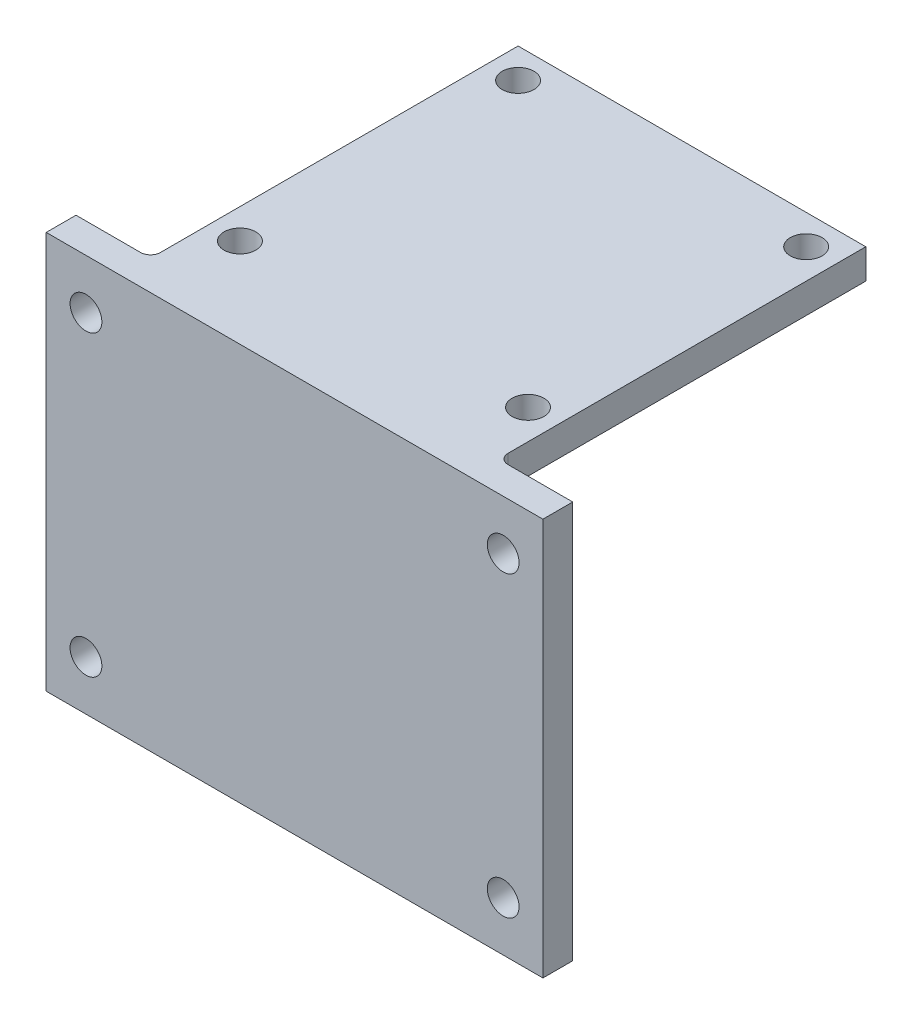
ISO-10303-21;
HEADER;
FILE_DESCRIPTION(('STEP AP214'),'2;1');
FILE_NAME('part.step','',(''),(''),'','','');
FILE_SCHEMA(('AUTOMOTIVE_DESIGN { 1 0 10303 214 1 1 1 1 }'));
ENDSEC;
DATA;
#1=APPLICATION_CONTEXT('core data for automotive mechanical design processes');
#2=APPLICATION_PROTOCOL_DEFINITION('international standard','automotive_design',2000,#1);
#3=PRODUCT_CONTEXT('',#1,'mechanical');
#4=PRODUCT('Part','Part','',(#3));
#5=PRODUCT_RELATED_PRODUCT_CATEGORY('part','',(#4));
#6=PRODUCT_DEFINITION_FORMATION('','',#4);
#7=PRODUCT_DEFINITION_CONTEXT('part definition',#1,'design');
#8=PRODUCT_DEFINITION('design','',#6,#7);
#9=PRODUCT_DEFINITION_SHAPE('','',#8);
#10=(LENGTH_UNIT() NAMED_UNIT(*) SI_UNIT(.MILLI.,.METRE.));
#11=(NAMED_UNIT(*) PLANE_ANGLE_UNIT() SI_UNIT($,.RADIAN.));
#12=(NAMED_UNIT(*) SI_UNIT($,.STERADIAN.) SOLID_ANGLE_UNIT());
#13=UNCERTAINTY_MEASURE_WITH_UNIT(LENGTH_MEASURE(1.E-05),#10,'distance_accuracy_value','');
#14=(GEOMETRIC_REPRESENTATION_CONTEXT(3) GLOBAL_UNCERTAINTY_ASSIGNED_CONTEXT((#13)) GLOBAL_UNIT_ASSIGNED_CONTEXT((#10,
#11,#12)) REPRESENTATION_CONTEXT('',''));
#15=CARTESIAN_POINT('',(0.,0.,0.));
#16=DIRECTION('',(0.,0.,1.));
#17=DIRECTION('',(1.,0.,0.));
#18=AXIS2_PLACEMENT_3D('',#15,#16,#17);
#19=CARTESIAN_POINT('',(0.,3.,0.));
#20=DIRECTION('',(0.,1.,0.));
#21=DIRECTION('',(0.,0.,1.));
#22=AXIS2_PLACEMENT_3D('',#19,#20,#21);
#23=PLANE('',#22);
#24=CARTESIAN_POINT('',(17.0952061206293,3.,17.4927670175082));
#25=DIRECTION('',(0.,1.,0.));
#26=DIRECTION('',(0.,0.,1.));
#27=AXIS2_PLACEMENT_3D('',#24,#25,#26);
#28=CIRCLE('',#27,1.6);
#29=CARTESIAN_POINT('',(17.0952061206293,3.,19.0927670175082));
#30=VERTEX_POINT('',#29);
#31=EDGE_CURVE('E154',#30,#30,#28,.T.);
#32=ORIENTED_EDGE('',*,*,#31,.F.);
#33=EDGE_LOOP('',(#32));
#34=FACE_BOUND('',#33,.T.);
#35=CARTESIAN_POINT('',(-11.9047938793707,3.,-10.5072329824918));
#36=DIRECTION('',(0.,1.,0.));
#37=DIRECTION('',(0.,0.,1.));
#38=AXIS2_PLACEMENT_3D('',#35,#36,#37);
#39=CIRCLE('',#38,1.6);
#40=CARTESIAN_POINT('',(-11.9047938793707,3.,-8.90723298249175));
#41=VERTEX_POINT('',#40);
#42=EDGE_CURVE('E166',#41,#41,#39,.T.);
#43=ORIENTED_EDGE('',*,*,#42,.F.);
#44=EDGE_LOOP('',(#43));
#45=FACE_BOUND('',#44,.T.);
#46=DIRECTION('',(0.,0.,1.));
#47=VECTOR('',#46,1.);
#48=CARTESIAN_POINT('',(-14.9047938793707,3.,-13.5072329824918));
#49=LINE('',#48,#47);
#50=CARTESIAN_POINT('',(-14.9047938793707,3.,-13.5072329824918));
#51=VERTEX_POINT('',#50);
#52=CARTESIAN_POINT('',(-14.9047938793707,3.,22.4927670175082));
#53=VERTEX_POINT('',#52);
#54=EDGE_CURVE('E172',#51,#53,#49,.T.);
#55=ORIENTED_EDGE('',*,*,#54,.T.);
#56=CARTESIAN_POINT('',(-15.9047938793707,3.,22.4927670175082));
#57=DIRECTION('',(0.,1.,0.));
#58=DIRECTION('',(0.,0.,1.));
#59=AXIS2_PLACEMENT_3D('',#56,#57,#58);
#60=CIRCLE('',#59,1.);
#61=CARTESIAN_POINT('',(-15.9047938793707,3.,23.4927670175082));
#62=VERTEX_POINT('',#61);
#63=EDGE_CURVE('E208',#53,#62,#60,.F.);
#64=ORIENTED_EDGE('',*,*,#63,.T.);
#65=DIRECTION('',(-1.,0.,0.));
#66=VECTOR('',#65,1.);
#67=CARTESIAN_POINT('',(27.5952061206293,3.,23.4927670175082));
#68=LINE('',#67,#66);
#69=CARTESIAN_POINT('',(-22.4047938793707,3.,23.4927670175082));
#70=VERTEX_POINT('',#69);
#71=EDGE_CURVE('E233',#62,#70,#68,.T.);
#72=ORIENTED_EDGE('',*,*,#71,.T.);
#73=DIRECTION('',(0.,0.,-1.));
#74=VECTOR('',#73,1.);
#75=CARTESIAN_POINT('',(-22.4047938793707,3.,26.4927670175082));
#76=LINE('',#75,#74);
#77=CARTESIAN_POINT('',(-22.4047938793707,3.,26.4927670175082));
#78=VERTEX_POINT('',#77);
#79=EDGE_CURVE('E123',#78,#70,#76,.T.);
#80=ORIENTED_EDGE('',*,*,#79,.F.);
#81=DIRECTION('',(-1.,0.,0.));
#82=VECTOR('',#81,1.);
#83=CARTESIAN_POINT('',(27.5952061206293,3.,26.4927670175082));
#84=LINE('',#83,#82);
#85=CARTESIAN_POINT('',(27.5952061206293,3.,26.4927670175082));
#86=VERTEX_POINT('',#85);
#87=EDGE_CURVE('E115',#86,#78,#84,.T.);
#88=ORIENTED_EDGE('',*,*,#87,.F.);
#89=DIRECTION('',(0.,0.,-1.));
#90=VECTOR('',#89,1.);
#91=CARTESIAN_POINT('',(27.5952061206293,3.,26.4927670175082));
#92=LINE('',#91,#90);
#93=CARTESIAN_POINT('',(27.5952061206293,3.,23.4927670175082));
#94=VERTEX_POINT('',#93);
#95=EDGE_CURVE('E120',#86,#94,#92,.T.);
#96=ORIENTED_EDGE('',*,*,#95,.T.);
#97=CARTESIAN_POINT('',(21.0952061206293,3.,23.4927670175082));
#98=VERTEX_POINT('',#97);
#99=EDGE_CURVE('E242',#94,#98,#68,.T.);
#100=ORIENTED_EDGE('',*,*,#99,.T.);
#101=CARTESIAN_POINT('',(21.0952061206293,3.,22.4927670175082));
#102=DIRECTION('',(0.,1.,0.));
#103=DIRECTION('',(0.,0.,1.));
#104=AXIS2_PLACEMENT_3D('',#101,#102,#103);
#105=CIRCLE('',#104,1.);
#106=CARTESIAN_POINT('',(20.0952061206293,3.,22.4927670175082));
#107=VERTEX_POINT('',#106);
#108=EDGE_CURVE('E11',#98,#107,#105,.F.);
#109=ORIENTED_EDGE('',*,*,#108,.T.);
#110=DIRECTION('',(0.,0.,-1.));
#111=VECTOR('',#110,1.);
#112=CARTESIAN_POINT('',(20.0952061206293,3.,-13.5072329824918));
#113=LINE('',#112,#111);
#114=CARTESIAN_POINT('',(20.0952061206293,3.,-13.5072329824918));
#115=VERTEX_POINT('',#114);
#116=EDGE_CURVE('E174',#107,#115,#113,.T.);
#117=ORIENTED_EDGE('',*,*,#116,.T.);
#118=DIRECTION('',(-1.,0.,0.));
#119=VECTOR('',#118,1.);
#120=CARTESIAN_POINT('',(-14.9047938793707,3.,-13.5072329824918));
#121=LINE('',#120,#119);
#122=EDGE_CURVE('E177',#115,#51,#121,.T.);
#123=ORIENTED_EDGE('',*,*,#122,.T.);
#124=EDGE_LOOP('',(#55,#64,#72,#80,#88,#96,#100,#109,#117,#123));
#125=FACE_BOUND('',#124,.T.);
#126=CARTESIAN_POINT('',(-11.9047938793707,3.,17.4927670175082));
#127=DIRECTION('',(0.,1.,0.));
#128=DIRECTION('',(0.,0.,1.));
#129=AXIS2_PLACEMENT_3D('',#126,#127,#128);
#130=CIRCLE('',#129,1.6);
#131=CARTESIAN_POINT('',(-11.9047938793707,3.,19.0927670175082));
#132=VERTEX_POINT('',#131);
#133=EDGE_CURVE('E160',#132,#132,#130,.T.);
#134=ORIENTED_EDGE('',*,*,#133,.F.);
#135=EDGE_LOOP('',(#134));
#136=FACE_BOUND('',#135,.T.);
#137=CARTESIAN_POINT('',(17.0952061206293,3.,-10.5072329824918));
#138=DIRECTION('',(0.,1.,0.));
#139=DIRECTION('',(0.,0.,1.));
#140=AXIS2_PLACEMENT_3D('',#137,#138,#139);
#141=CIRCLE('',#140,1.6);
#142=CARTESIAN_POINT('',(17.0952061206293,3.,-8.90723298249176));
#143=VERTEX_POINT('',#142);
#144=EDGE_CURVE('E145',#143,#143,#141,.T.);
#145=ORIENTED_EDGE('',*,*,#144,.F.);
#146=EDGE_LOOP('',(#145));
#147=FACE_BOUND('',#146,.T.);
#148=ADVANCED_FACE('F33',(#34,#45,#125,#136,#147),#23,.T.);
#149=CARTESIAN_POINT('',(0.,0.,0.));
#150=DIRECTION('',(0.,1.,0.));
#151=DIRECTION('',(0.,0.,1.));
#152=AXIS2_PLACEMENT_3D('',#149,#150,#151);
#153=PLANE('',#152);
#154=DIRECTION('',(0.,0.,-1.));
#155=VECTOR('',#154,1.);
#156=CARTESIAN_POINT('',(20.0952061206293,0.,-13.5072329824918));
#157=LINE('',#156,#155);
#158=CARTESIAN_POINT('',(20.0952061206293,0.,20.4927670175082));
#159=VERTEX_POINT('',#158);
#160=CARTESIAN_POINT('',(20.0952061206293,0.,-13.5072329824918));
#161=VERTEX_POINT('',#160);
#162=EDGE_CURVE('E182',#159,#161,#157,.T.);
#163=ORIENTED_EDGE('',*,*,#162,.F.);
#164=DIRECTION('',(1.,0.,0.));
#165=VECTOR('',#164,1.);
#166=CARTESIAN_POINT('',(0.,0.,20.4927670175082));
#167=LINE('',#166,#165);
#168=CARTESIAN_POINT('',(-14.9047938793707,0.,20.4927670175082));
#169=VERTEX_POINT('',#168);
#170=EDGE_CURVE('E191',#159,#169,#167,.F.);
#171=ORIENTED_EDGE('',*,*,#170,.T.);
#172=DIRECTION('',(0.,0.,1.));
#173=VECTOR('',#172,1.);
#174=CARTESIAN_POINT('',(-14.9047938793707,0.,-13.5072329824918));
#175=LINE('',#174,#173);
#176=CARTESIAN_POINT('',(-14.9047938793707,0.,-13.5072329824918));
#177=VERTEX_POINT('',#176);
#178=EDGE_CURVE('E169',#177,#169,#175,.T.);
#179=ORIENTED_EDGE('',*,*,#178,.F.);
#180=DIRECTION('',(-1.,0.,0.));
#181=VECTOR('',#180,1.);
#182=CARTESIAN_POINT('',(-14.9047938793707,0.,-13.5072329824918));
#183=LINE('',#182,#181);
#184=EDGE_CURVE('E175',#161,#177,#183,.T.);
#185=ORIENTED_EDGE('',*,*,#184,.F.);
#186=EDGE_LOOP('',(#163,#171,#179,#185));
#187=FACE_BOUND('',#186,.T.);
#188=CARTESIAN_POINT('',(-11.9047938793707,0.,-10.5072329824918));
#189=DIRECTION('',(0.,1.,0.));
#190=DIRECTION('',(0.,0.,1.));
#191=AXIS2_PLACEMENT_3D('',#188,#189,#190);
#192=CIRCLE('',#191,1.6);
#193=CARTESIAN_POINT('',(-11.9047938793707,0.,-8.90723298249175));
#194=VERTEX_POINT('',#193);
#195=EDGE_CURVE('E163',#194,#194,#192,.T.);
#196=ORIENTED_EDGE('',*,*,#195,.T.);
#197=EDGE_LOOP('',(#196));
#198=FACE_BOUND('',#197,.T.);
#199=CARTESIAN_POINT('',(-11.9047938793707,0.,17.4927670175082));
#200=DIRECTION('',(0.,1.,0.));
#201=DIRECTION('',(0.,0.,1.));
#202=AXIS2_PLACEMENT_3D('',#199,#200,#201);
#203=CIRCLE('',#202,1.6);
#204=CARTESIAN_POINT('',(-11.9047938793707,0.,19.0927670175082));
#205=VERTEX_POINT('',#204);
#206=EDGE_CURVE('E157',#205,#205,#203,.T.);
#207=ORIENTED_EDGE('',*,*,#206,.T.);
#208=EDGE_LOOP('',(#207));
#209=FACE_BOUND('',#208,.T.);
#210=CARTESIAN_POINT('',(17.0952061206293,0.,17.4927670175082));
#211=DIRECTION('',(0.,1.,0.));
#212=DIRECTION('',(0.,0.,1.));
#213=AXIS2_PLACEMENT_3D('',#210,#211,#212);
#214=CIRCLE('',#213,1.6);
#215=CARTESIAN_POINT('',(17.0952061206293,0.,19.0927670175082));
#216=VERTEX_POINT('',#215);
#217=EDGE_CURVE('E152',#216,#216,#214,.T.);
#218=ORIENTED_EDGE('',*,*,#217,.T.);
#219=EDGE_LOOP('',(#218));
#220=FACE_BOUND('',#219,.T.);
#221=CARTESIAN_POINT('',(17.0952061206293,0.,-10.5072329824918));
#222=DIRECTION('',(0.,1.,0.));
#223=DIRECTION('',(0.,0.,1.));
#224=AXIS2_PLACEMENT_3D('',#221,#222,#223);
#225=CIRCLE('',#224,1.6);
#226=CARTESIAN_POINT('',(17.0952061206293,0.,-8.90723298249176));
#227=VERTEX_POINT('',#226);
#228=EDGE_CURVE('E142',#227,#227,#225,.T.);
#229=ORIENTED_EDGE('',*,*,#228,.T.);
#230=EDGE_LOOP('',(#229));
#231=FACE_BOUND('',#230,.T.);
#232=ADVANCED_FACE('F253',(#187,#198,#209,#220,#231),#153,.F.);
#233=CARTESIAN_POINT('',(-14.9047938793707,3.,-13.5072329824918));
#234=DIRECTION('',(1.,0.,0.));
#235=DIRECTION('',(0.,0.,-1.));
#236=AXIS2_PLACEMENT_3D('',#233,#234,#235);
#237=PLANE('',#236);
#238=CARTESIAN_POINT('',(-14.9047938793707,-3.,20.4927670175082));
#239=DIRECTION('',(1.,0.,0.));
#240=DIRECTION('',(0.,0.,-1.));
#241=AXIS2_PLACEMENT_3D('',#238,#239,#240);
#242=CIRCLE('',#241,3.);
#243=CARTESIAN_POINT('',(-14.9047938793707,-0.763932022500208,22.4927670175082));
#244=VERTEX_POINT('',#243);
#245=EDGE_CURVE('E195',#169,#244,#242,.T.);
#246=ORIENTED_EDGE('',*,*,#245,.T.);
#247=DIRECTION('',(0.,-1.,0.));
#248=VECTOR('',#247,1.);
#249=CARTESIAN_POINT('',(-14.9047938793707,3.,22.4927670175082));
#250=LINE('',#249,#248);
#251=EDGE_CURVE('E200',#244,#53,#250,.F.);
#252=ORIENTED_EDGE('',*,*,#251,.T.);
#253=ORIENTED_EDGE('',*,*,#54,.F.);
#254=DIRECTION('',(0.,-1.,0.));
#255=VECTOR('',#254,1.);
#256=CARTESIAN_POINT('',(-14.9047938793707,3.,-13.5072329824918));
#257=LINE('',#256,#255);
#258=EDGE_CURVE('E179',#51,#177,#257,.T.);
#259=ORIENTED_EDGE('',*,*,#258,.T.);
#260=ORIENTED_EDGE('',*,*,#178,.T.);
#261=EDGE_LOOP('',(#246,#252,#253,#259,#260));
#262=FACE_BOUND('',#261,.T.);
#263=ADVANCED_FACE('F218',(#262),#237,.F.);
#264=CARTESIAN_POINT('',(20.0952061206293,3.,-13.5072329824918));
#265=DIRECTION('',(-1.,0.,0.));
#266=DIRECTION('',(0.,0.,1.));
#267=AXIS2_PLACEMENT_3D('',#264,#265,#266);
#268=PLANE('',#267);
#269=ORIENTED_EDGE('',*,*,#116,.F.);
#270=DIRECTION('',(0.,-1.,0.));
#271=VECTOR('',#270,1.);
#272=CARTESIAN_POINT('',(20.0952061206293,3.,22.4927670175082));
#273=LINE('',#272,#271);
#274=CARTESIAN_POINT('',(20.0952061206293,-0.763932022500208,22.4927670175082));
#275=VERTEX_POINT('',#274);
#276=EDGE_CURVE('E225',#107,#275,#273,.T.);
#277=ORIENTED_EDGE('',*,*,#276,.T.);
#278=CARTESIAN_POINT('',(20.0952061206293,-3.,20.4927670175082));
#279=DIRECTION('',(-1.,0.,0.));
#280=DIRECTION('',(0.,0.,1.));
#281=AXIS2_PLACEMENT_3D('',#278,#279,#280);
#282=CIRCLE('',#281,3.);
#283=EDGE_CURVE('E193',#275,#159,#282,.T.);
#284=ORIENTED_EDGE('',*,*,#283,.T.);
#285=ORIENTED_EDGE('',*,*,#162,.T.);
#286=DIRECTION('',(0.,-1.,0.));
#287=VECTOR('',#286,1.);
#288=CARTESIAN_POINT('',(20.0952061206293,3.,-13.5072329824918));
#289=LINE('',#288,#287);
#290=EDGE_CURVE('E187',#115,#161,#289,.T.);
#291=ORIENTED_EDGE('',*,*,#290,.F.);
#292=EDGE_LOOP('',(#269,#277,#284,#285,#291));
#293=FACE_BOUND('',#292,.T.);
#294=ADVANCED_FACE('F255',(#293),#268,.F.);
#295=CARTESIAN_POINT('',(-14.9047938793707,3.,-13.5072329824918));
#296=DIRECTION('',(0.,0.,1.));
#297=DIRECTION('',(1.,0.,0.));
#298=AXIS2_PLACEMENT_3D('',#295,#296,#297);
#299=PLANE('',#298);
#300=ORIENTED_EDGE('',*,*,#184,.T.);
#301=ORIENTED_EDGE('',*,*,#258,.F.);
#302=ORIENTED_EDGE('',*,*,#122,.F.);
#303=ORIENTED_EDGE('',*,*,#290,.T.);
#304=EDGE_LOOP('',(#300,#301,#302,#303));
#305=FACE_BOUND('',#304,.T.);
#306=ADVANCED_FACE('F259',(#305),#299,.F.);
#307=CARTESIAN_POINT('',(-11.9047938793707,3.,-10.5072329824918));
#308=DIRECTION('',(0.,-1.,0.));
#309=DIRECTION('',(0.,0.,-1.));
#310=AXIS2_PLACEMENT_3D('',#307,#308,#309);
#311=CYLINDRICAL_SURFACE('',#310,1.6);
#312=ORIENTED_EDGE('',*,*,#42,.T.);
#313=EDGE_LOOP('',(#312));
#314=FACE_BOUND('',#313,.T.);
#315=ORIENTED_EDGE('',*,*,#195,.F.);
#316=EDGE_LOOP('',(#315));
#317=FACE_BOUND('',#316,.T.);
#318=ADVANCED_FACE('F276',(#314,#317),#311,.F.);
#319=CARTESIAN_POINT('',(-11.9047938793707,3.,17.4927670175082));
#320=DIRECTION('',(0.,-1.,0.));
#321=DIRECTION('',(0.,0.,-1.));
#322=AXIS2_PLACEMENT_3D('',#319,#320,#321);
#323=CYLINDRICAL_SURFACE('',#322,1.6);
#324=ORIENTED_EDGE('',*,*,#133,.T.);
#325=EDGE_LOOP('',(#324));
#326=FACE_BOUND('',#325,.T.);
#327=ORIENTED_EDGE('',*,*,#206,.F.);
#328=EDGE_LOOP('',(#327));
#329=FACE_BOUND('',#328,.T.);
#330=ADVANCED_FACE('F391',(#326,#329),#323,.F.);
#331=CARTESIAN_POINT('',(17.0952061206293,3.,17.4927670175082));
#332=DIRECTION('',(0.,-1.,0.));
#333=DIRECTION('',(0.,0.,-1.));
#334=AXIS2_PLACEMENT_3D('',#331,#332,#333);
#335=CYLINDRICAL_SURFACE('',#334,1.6);
#336=ORIENTED_EDGE('',*,*,#31,.T.);
#337=EDGE_LOOP('',(#336));
#338=FACE_BOUND('',#337,.T.);
#339=ORIENTED_EDGE('',*,*,#217,.F.);
#340=EDGE_LOOP('',(#339));
#341=FACE_BOUND('',#340,.T.);
#342=ADVANCED_FACE('F380',(#338,#341),#335,.F.);
#343=CARTESIAN_POINT('',(17.0952061206293,3.,-10.5072329824918));
#344=DIRECTION('',(0.,-1.,0.));
#345=DIRECTION('',(0.,0.,-1.));
#346=AXIS2_PLACEMENT_3D('',#343,#344,#345);
#347=CYLINDRICAL_SURFACE('',#346,1.6);
#348=ORIENTED_EDGE('',*,*,#144,.T.);
#349=EDGE_LOOP('',(#348));
#350=FACE_BOUND('',#349,.T.);
#351=ORIENTED_EDGE('',*,*,#228,.F.);
#352=EDGE_LOOP('',(#351));
#353=FACE_BOUND('',#352,.T.);
#354=ADVANCED_FACE('F375',(#350,#353),#347,.F.);
#355=CARTESIAN_POINT('',(0.,0.,23.4927670175082));
#356=DIRECTION('',(0.,0.,-1.));
#357=DIRECTION('',(-1.,0.,0.));
#358=AXIS2_PLACEMENT_3D('',#355,#356,#357);
#359=PLANE('',#358);
#360=CARTESIAN_POINT('',(-18.4047938793707,-32.,23.4927670175082));
#361=DIRECTION('',(0.,0.,1.));
#362=DIRECTION('',(1.,0.,0.));
#363=AXIS2_PLACEMENT_3D('',#360,#361,#362);
#364=CIRCLE('',#363,1.6);
#365=CARTESIAN_POINT('',(-16.8047938793707,-32.,23.4927670175082));
#366=VERTEX_POINT('',#365);
#367=EDGE_CURVE('E453',#366,#366,#364,.T.);
#368=ORIENTED_EDGE('',*,*,#367,.T.);
#369=EDGE_LOOP('',(#368));
#370=FACE_BOUND('',#369,.T.);
#371=CARTESIAN_POINT('',(23.5952061206293,-2.,23.4927670175082));
#372=DIRECTION('',(0.,0.,1.));
#373=DIRECTION('',(1.,0.,0.));
#374=AXIS2_PLACEMENT_3D('',#371,#372,#373);
#375=CIRCLE('',#374,1.6);
#376=CARTESIAN_POINT('',(25.1952061206293,-2.,23.4927670175082));
#377=VERTEX_POINT('',#376);
#378=EDGE_CURVE('E457',#377,#377,#375,.T.);
#379=ORIENTED_EDGE('',*,*,#378,.T.);
#380=EDGE_LOOP('',(#379));
#381=FACE_BOUND('',#380,.T.);
#382=CARTESIAN_POINT('',(23.5952061206293,-32.,23.4927670175082));
#383=DIRECTION('',(0.,0.,1.));
#384=DIRECTION('',(1.,0.,0.));
#385=AXIS2_PLACEMENT_3D('',#382,#383,#384);
#386=CIRCLE('',#385,1.6);
#387=CARTESIAN_POINT('',(25.1952061206293,-32.,23.4927670175082));
#388=VERTEX_POINT('',#387);
#389=EDGE_CURVE('E461',#388,#388,#386,.T.);
#390=ORIENTED_EDGE('',*,*,#389,.T.);
#391=EDGE_LOOP('',(#390));
#392=FACE_BOUND('',#391,.T.);
#393=CARTESIAN_POINT('',(-18.4047938793707,-2.,23.4927670175082));
#394=DIRECTION('',(0.,0.,1.));
#395=DIRECTION('',(1.,0.,0.));
#396=AXIS2_PLACEMENT_3D('',#393,#394,#395);
#397=CIRCLE('',#396,1.6);
#398=CARTESIAN_POINT('',(-16.8047938793707,-2.,23.4927670175082));
#399=VERTEX_POINT('',#398);
#400=EDGE_CURVE('E464',#399,#399,#397,.T.);
#401=ORIENTED_EDGE('',*,*,#400,.T.);
#402=EDGE_LOOP('',(#401));
#403=FACE_BOUND('',#402,.T.);
#404=DIRECTION('',(1.,0.,0.));
#405=VECTOR('',#404,1.);
#406=CARTESIAN_POINT('',(0.,-3.,23.4927670175082));
#407=LINE('',#406,#405);
#408=CARTESIAN_POINT('',(-15.9047938793707,-3.,23.4927670175082));
#409=VERTEX_POINT('',#408);
#410=CARTESIAN_POINT('',(21.0952061206293,-3.,23.4927670175082));
#411=VERTEX_POINT('',#410);
#412=EDGE_CURVE('E49',#409,#411,#407,.T.);
#413=ORIENTED_EDGE('',*,*,#412,.T.);
#414=DIRECTION('',(0.,-1.,0.));
#415=VECTOR('',#414,1.);
#416=CARTESIAN_POINT('',(21.0952061206293,0.,23.4927670175082));
#417=LINE('',#416,#415);
#418=EDGE_CURVE('E54',#411,#98,#417,.F.);
#419=ORIENTED_EDGE('',*,*,#418,.T.);
#420=ORIENTED_EDGE('',*,*,#99,.F.);
#421=DIRECTION('',(0.,1.,0.));
#422=VECTOR('',#421,1.);
#423=CARTESIAN_POINT('',(27.5952061206293,3.,23.4927670175082));
#424=LINE('',#423,#422);
#425=CARTESIAN_POINT('',(27.5952061206293,-37.,23.4927670175082));
#426=VERTEX_POINT('',#425);
#427=EDGE_CURVE('E141',#426,#94,#424,.T.);
#428=ORIENTED_EDGE('',*,*,#427,.F.);
#429=DIRECTION('',(1.,0.,0.));
#430=VECTOR('',#429,1.);
#431=CARTESIAN_POINT('',(27.5952061206293,-37.,23.4927670175082));
#432=LINE('',#431,#430);
#433=CARTESIAN_POINT('',(-22.4047938793707,-37.,23.4927670175082));
#434=VERTEX_POINT('',#433);
#435=EDGE_CURVE('E137',#434,#426,#432,.T.);
#436=ORIENTED_EDGE('',*,*,#435,.F.);
#437=DIRECTION('',(0.,-1.,0.));
#438=VECTOR('',#437,1.);
#439=CARTESIAN_POINT('',(-22.4047938793707,3.,23.4927670175082));
#440=LINE('',#439,#438);
#441=EDGE_CURVE('E241',#70,#434,#440,.T.);
#442=ORIENTED_EDGE('',*,*,#441,.F.);
#443=ORIENTED_EDGE('',*,*,#71,.F.);
#444=DIRECTION('',(0.,-1.,0.));
#445=VECTOR('',#444,1.);
#446=CARTESIAN_POINT('',(-15.9047938793707,0.,23.4927670175082));
#447=LINE('',#446,#445);
#448=EDGE_CURVE('E198',#62,#409,#447,.T.);
#449=ORIENTED_EDGE('',*,*,#448,.T.);
#450=EDGE_LOOP('',(#413,#419,#420,#428,#436,#442,#443,#449));
#451=FACE_BOUND('',#450,.T.);
#452=ADVANCED_FACE('F239',(#370,#381,#392,#403,#451),#359,.T.);
#453=CARTESIAN_POINT('',(0.,0.,26.4927670175082));
#454=DIRECTION('',(0.,0.,-1.));
#455=DIRECTION('',(-1.,0.,0.));
#456=AXIS2_PLACEMENT_3D('',#453,#454,#455);
#457=PLANE('',#456);
#458=DIRECTION('',(0.,1.,0.));
#459=VECTOR('',#458,1.);
#460=CARTESIAN_POINT('',(27.5952061206293,3.,26.4927670175082));
#461=LINE('',#460,#459);
#462=CARTESIAN_POINT('',(27.5952061206293,-37.,26.4927670175082));
#463=VERTEX_POINT('',#462);
#464=EDGE_CURVE('E127',#463,#86,#461,.T.);
#465=ORIENTED_EDGE('',*,*,#464,.T.);
#466=ORIENTED_EDGE('',*,*,#87,.T.);
#467=DIRECTION('',(0.,-1.,0.));
#468=VECTOR('',#467,1.);
#469=CARTESIAN_POINT('',(-22.4047938793707,3.,26.4927670175082));
#470=LINE('',#469,#468);
#471=CARTESIAN_POINT('',(-22.4047938793707,-37.,26.4927670175082));
#472=VERTEX_POINT('',#471);
#473=EDGE_CURVE('E126',#78,#472,#470,.T.);
#474=ORIENTED_EDGE('',*,*,#473,.T.);
#475=DIRECTION('',(1.,0.,0.));
#476=VECTOR('',#475,1.);
#477=CARTESIAN_POINT('',(27.5952061206293,-37.,26.4927670175082));
#478=LINE('',#477,#476);
#479=EDGE_CURVE('E133',#472,#463,#478,.T.);
#480=ORIENTED_EDGE('',*,*,#479,.T.);
#481=EDGE_LOOP('',(#465,#466,#474,#480));
#482=FACE_BOUND('',#481,.T.);
#483=CARTESIAN_POINT('',(23.5952061206293,-32.,26.4927670175082));
#484=DIRECTION('',(0.,0.,1.));
#485=DIRECTION('',(1.,0.,0.));
#486=AXIS2_PLACEMENT_3D('',#483,#484,#485);
#487=CIRCLE('',#486,1.6);
#488=CARTESIAN_POINT('',(25.1952061206293,-32.,26.4927670175082));
#489=VERTEX_POINT('',#488);
#490=EDGE_CURVE('E479',#489,#489,#487,.T.);
#491=ORIENTED_EDGE('',*,*,#490,.F.);
#492=EDGE_LOOP('',(#491));
#493=FACE_BOUND('',#492,.T.);
#494=CARTESIAN_POINT('',(23.5952061206293,-2.,26.4927670175082));
#495=DIRECTION('',(0.,0.,1.));
#496=DIRECTION('',(1.,0.,0.));
#497=AXIS2_PLACEMENT_3D('',#494,#495,#496);
#498=CIRCLE('',#497,1.6);
#499=CARTESIAN_POINT('',(25.1952061206293,-2.,26.4927670175082));
#500=VERTEX_POINT('',#499);
#501=EDGE_CURVE('E475',#500,#500,#498,.T.);
#502=ORIENTED_EDGE('',*,*,#501,.F.);
#503=EDGE_LOOP('',(#502));
#504=FACE_BOUND('',#503,.T.);
#505=CARTESIAN_POINT('',(-18.4047938793707,-2.,26.4927670175082));
#506=DIRECTION('',(0.,0.,1.));
#507=DIRECTION('',(1.,0.,0.));
#508=AXIS2_PLACEMENT_3D('',#505,#506,#507);
#509=CIRCLE('',#508,1.6);
#510=CARTESIAN_POINT('',(-16.8047938793707,-2.,26.4927670175082));
#511=VERTEX_POINT('',#510);
#512=EDGE_CURVE('E466',#511,#511,#509,.T.);
#513=ORIENTED_EDGE('',*,*,#512,.F.);
#514=EDGE_LOOP('',(#513));
#515=FACE_BOUND('',#514,.T.);
#516=CARTESIAN_POINT('',(-18.4047938793707,-32.,26.4927670175082));
#517=DIRECTION('',(0.,0.,1.));
#518=DIRECTION('',(1.,0.,0.));
#519=AXIS2_PLACEMENT_3D('',#516,#517,#518);
#520=CIRCLE('',#519,1.6);
#521=CARTESIAN_POINT('',(-16.8047938793707,-32.,26.4927670175082));
#522=VERTEX_POINT('',#521);
#523=EDGE_CURVE('E467',#522,#522,#520,.T.);
#524=ORIENTED_EDGE('',*,*,#523,.F.);
#525=EDGE_LOOP('',(#524));
#526=FACE_BOUND('',#525,.T.);
#527=ADVANCED_FACE('F130',(#482,#493,#504,#515,#526),#457,.F.);
#528=CARTESIAN_POINT('',(27.5952061206293,3.,26.4927670175082));
#529=DIRECTION('',(-1.,0.,0.));
#530=DIRECTION('',(0.,-1.,0.));
#531=AXIS2_PLACEMENT_3D('',#528,#529,#530);
#532=PLANE('',#531);
#533=ORIENTED_EDGE('',*,*,#427,.T.);
#534=ORIENTED_EDGE('',*,*,#95,.F.);
#535=ORIENTED_EDGE('',*,*,#464,.F.);
#536=DIRECTION('',(0.,0.,-1.));
#537=VECTOR('',#536,1.);
#538=CARTESIAN_POINT('',(27.5952061206293,-37.,26.4927670175082));
#539=LINE('',#538,#537);
#540=EDGE_CURVE('E485',#463,#426,#539,.T.);
#541=ORIENTED_EDGE('',*,*,#540,.T.);
#542=EDGE_LOOP('',(#533,#534,#535,#541));
#543=FACE_BOUND('',#542,.T.);
#544=ADVANCED_FACE('F139',(#543),#532,.F.);
#545=CARTESIAN_POINT('',(-22.4047938793707,3.,26.4927670175082));
#546=DIRECTION('',(1.,0.,0.));
#547=DIRECTION('',(0.,1.,0.));
#548=AXIS2_PLACEMENT_3D('',#545,#546,#547);
#549=PLANE('',#548);
#550=ORIENTED_EDGE('',*,*,#441,.T.);
#551=DIRECTION('',(0.,0.,-1.));
#552=VECTOR('',#551,1.);
#553=CARTESIAN_POINT('',(-22.4047938793707,-37.,26.4927670175082));
#554=LINE('',#553,#552);
#555=EDGE_CURVE('E147',#472,#434,#554,.T.);
#556=ORIENTED_EDGE('',*,*,#555,.F.);
#557=ORIENTED_EDGE('',*,*,#473,.F.);
#558=ORIENTED_EDGE('',*,*,#79,.T.);
#559=EDGE_LOOP('',(#550,#556,#557,#558));
#560=FACE_BOUND('',#559,.T.);
#561=ADVANCED_FACE('F342',(#560),#549,.F.);
#562=CARTESIAN_POINT('',(27.5952061206293,-37.,26.4927670175082));
#563=DIRECTION('',(0.,1.,0.));
#564=DIRECTION('',(-1.,0.,0.));
#565=AXIS2_PLACEMENT_3D('',#562,#563,#564);
#566=PLANE('',#565);
#567=ORIENTED_EDGE('',*,*,#435,.T.);
#568=ORIENTED_EDGE('',*,*,#540,.F.);
#569=ORIENTED_EDGE('',*,*,#479,.F.);
#570=ORIENTED_EDGE('',*,*,#555,.T.);
#571=EDGE_LOOP('',(#567,#568,#569,#570));
#572=FACE_BOUND('',#571,.T.);
#573=ADVANCED_FACE('F332',(#572),#566,.F.);
#574=CARTESIAN_POINT('',(23.5952061206293,-32.,26.4927670175082));
#575=DIRECTION('',(0.,0.,-1.));
#576=DIRECTION('',(-1.,0.,0.));
#577=AXIS2_PLACEMENT_3D('',#574,#575,#576);
#578=CYLINDRICAL_SURFACE('',#577,1.6);
#579=ORIENTED_EDGE('',*,*,#490,.T.);
#580=EDGE_LOOP('',(#579));
#581=FACE_BOUND('',#580,.T.);
#582=ORIENTED_EDGE('',*,*,#389,.F.);
#583=EDGE_LOOP('',(#582));
#584=FACE_BOUND('',#583,.T.);
#585=ADVANCED_FACE('F322',(#581,#584),#578,.F.);
#586=CARTESIAN_POINT('',(23.5952061206293,-2.,26.4927670175082));
#587=DIRECTION('',(0.,0.,-1.));
#588=DIRECTION('',(-1.,0.,0.));
#589=AXIS2_PLACEMENT_3D('',#586,#587,#588);
#590=CYLINDRICAL_SURFACE('',#589,1.6);
#591=ORIENTED_EDGE('',*,*,#501,.T.);
#592=EDGE_LOOP('',(#591));
#593=FACE_BOUND('',#592,.T.);
#594=ORIENTED_EDGE('',*,*,#378,.F.);
#595=EDGE_LOOP('',(#594));
#596=FACE_BOUND('',#595,.T.);
#597=ADVANCED_FACE('F312',(#593,#596),#590,.F.);
#598=CARTESIAN_POINT('',(-18.4047938793707,-2.,26.4927670175082));
#599=DIRECTION('',(0.,0.,-1.));
#600=DIRECTION('',(-1.,0.,0.));
#601=AXIS2_PLACEMENT_3D('',#598,#599,#600);
#602=CYLINDRICAL_SURFACE('',#601,1.6);
#603=ORIENTED_EDGE('',*,*,#512,.T.);
#604=EDGE_LOOP('',(#603));
#605=FACE_BOUND('',#604,.T.);
#606=ORIENTED_EDGE('',*,*,#400,.F.);
#607=EDGE_LOOP('',(#606));
#608=FACE_BOUND('',#607,.T.);
#609=ADVANCED_FACE('F301',(#605,#608),#602,.F.);
#610=CARTESIAN_POINT('',(-18.4047938793707,-32.,26.4927670175082));
#611=DIRECTION('',(0.,0.,-1.));
#612=DIRECTION('',(-1.,0.,0.));
#613=AXIS2_PLACEMENT_3D('',#610,#611,#612);
#614=CYLINDRICAL_SURFACE('',#613,1.6);
#615=ORIENTED_EDGE('',*,*,#523,.T.);
#616=EDGE_LOOP('',(#615));
#617=FACE_BOUND('',#616,.T.);
#618=ORIENTED_EDGE('',*,*,#367,.F.);
#619=EDGE_LOOP('',(#618));
#620=FACE_BOUND('',#619,.T.);
#621=ADVANCED_FACE('F216',(#617,#620),#614,.F.);
#622=CARTESIAN_POINT('',(0.,-3.,20.4927670175082));
#623=DIRECTION('',(1.,0.,0.));
#624=DIRECTION('',(0.,0.,-1.));
#625=AXIS2_PLACEMENT_3D('',#622,#623,#624);
#626=CYLINDRICAL_SURFACE('',#625,3.);
#627=ORIENTED_EDGE('',*,*,#245,.F.);
#628=ORIENTED_EDGE('',*,*,#170,.F.);
#629=ORIENTED_EDGE('',*,*,#283,.F.);
#630=CARTESIAN_POINT('',(20.0952061206293,-0.763932022500209,22.4927670175082));
#631=CARTESIAN_POINT('',(20.09521067614,-0.792242706292468,22.5244248947255));
#632=CARTESIAN_POINT('',(20.0967087511503,-0.821211418364641,22.5554544618853));
#633=CARTESIAN_POINT('',(20.1023731058141,-0.880272583793144,22.616099190014));
#634=CARTESIAN_POINT('',(20.1065359916046,-0.91036356200762,22.6457160986443));
#635=CARTESIAN_POINT('',(20.1224703524388,-1.00167985265057,22.7318932917745));
#636=CARTESIAN_POINT('',(20.1376974298351,-1.06438116497496,22.7862618646149));
#637=CARTESIAN_POINT('',(20.1876431384473,-1.23485549846259,22.9223283747373));
#638=CARTESIAN_POINT('',(20.2285949453416,-1.34517405450389,22.9985116506055));
#639=CARTESIAN_POINT('',(20.3233934265432,-1.57122763711817,23.1340042954314));
#640=CARTESIAN_POINT('',(20.3773192989633,-1.68699227408549,23.1932049315973));
#641=CARTESIAN_POINT('',(20.4766651939539,-1.88771483328579,23.280435941455));
#642=CARTESIAN_POINT('',(20.520067372103,-1.97195153256434,23.3125336983973));
#643=CARTESIAN_POINT('',(20.6098704567446,-2.14151288085255,23.3686990196559));
#644=CARTESIAN_POINT('',(20.6562728622098,-2.2268380563292,23.3927625323169));
#645=CARTESIAN_POINT('',(20.7982427011994,-2.48343795802623,23.4531699251552));
#646=CARTESIAN_POINT('',(20.8968721402437,-2.65591836049044,23.4779772509644));
#647=CARTESIAN_POINT('',(21.027348422517,-2.88245689276753,23.4909510638068));
#648=CARTESIAN_POINT('',(21.0585338558146,-2.93648121887146,23.4925811837909));
#649=CARTESIAN_POINT('',(21.0915546147733,-2.99367541449722,23.4927620155998));
#650=CARTESIAN_POINT('',(21.093380357476,-2.99683769380969,23.4927670153279));
#651=CARTESIAN_POINT('',(21.0952061206293,-3.,23.4927670175082));
#652=B_SPLINE_CURVE_WITH_KNOTS('',3,(#630,#631,#632,#633,#634,#635,#636,#637,#638,#639,#640,
#641,#642,#643,#644,#645,#646,#647,#648,#649,#650,#651),.UNSPECIFIED.,.F.,.F.,(4,2,2,2,2,2,2,2,
2,2,4),(0.,0.12732812437221,0.254494407314618,0.506902758847988,0.925154347494115,
1.34602692875661,1.64578712718784,1.94569826663478,2.54344782717992,2.7306215879237,
2.74157604934411),.UNSPECIFIED.);
#653=EDGE_CURVE('E42',#275,#411,#652,.T.);
#654=ORIENTED_EDGE('',*,*,#653,.T.);
#655=ORIENTED_EDGE('',*,*,#412,.F.);
#656=CARTESIAN_POINT('',(-14.9047938793707,-0.763932022500209,22.4927670175082));
#657=CARTESIAN_POINT('',(-14.9047984348814,-0.792242706292469,22.5244248947255));
#658=CARTESIAN_POINT('',(-14.9062965098917,-0.821211418364644,22.5554544618853));
#659=CARTESIAN_POINT('',(-14.9119608645555,-0.880272583793148,22.616099190014));
#660=CARTESIAN_POINT('',(-14.916123750346,-0.910363562007625,22.6457160986443));
#661=CARTESIAN_POINT('',(-14.9320581111802,-1.00167985265058,22.7318932917745));
#662=CARTESIAN_POINT('',(-14.9472851885765,-1.06438116497496,22.7862618646149));
#663=CARTESIAN_POINT('',(-14.9972308971887,-1.23485549846258,22.9223283747373));
#664=CARTESIAN_POINT('',(-15.0381827040829,-1.34517405450389,22.9985116506055));
#665=CARTESIAN_POINT('',(-15.1329811852846,-1.57122763711816,23.1340042954314));
#666=CARTESIAN_POINT('',(-15.1869070577047,-1.68699227408549,23.1932049315973));
#667=CARTESIAN_POINT('',(-15.2862529526953,-1.88771483328579,23.280435941455));
#668=CARTESIAN_POINT('',(-15.3296551308444,-1.97195153256434,23.3125336983973));
#669=CARTESIAN_POINT('',(-15.419458215486,-2.14151288085254,23.3686990196559));
#670=CARTESIAN_POINT('',(-15.4658606209512,-2.22683805632919,23.3927625323169));
#671=CARTESIAN_POINT('',(-15.6078304599407,-2.48343795802625,23.4531699251552));
#672=CARTESIAN_POINT('',(-15.7064598989849,-2.65591836049056,23.4779772509644));
#673=CARTESIAN_POINT('',(-15.8369361812585,-2.88245689276749,23.4909510638068));
#674=CARTESIAN_POINT('',(-15.8681216145562,-2.93648121887136,23.4925811837909));
#675=CARTESIAN_POINT('',(-15.9011423735147,-2.99367541449721,23.4927620155998));
#676=CARTESIAN_POINT('',(-15.9029681162174,-2.99683769380968,23.4927670153279));
#677=CARTESIAN_POINT('',(-15.9047938793707,-3.,23.4927670175082));
#678=B_SPLINE_CURVE_WITH_KNOTS('',3,(#656,#657,#658,#659,#660,#661,#662,#663,#664,#665,#666,
#667,#668,#669,#670,#671,#672,#673,#674,#675,#676,#677),.UNSPECIFIED.,.F.,.F.,(4,2,2,2,2,2,2,2,
2,2,4),(0.,0.127328124372215,0.254494407314628,0.506902758847988,0.925154347494109,
1.34602692875661,1.64578712718784,1.94569826663478,2.54344782717992,2.7306215879237,
2.74157604934411),.UNSPECIFIED.);
#679=EDGE_CURVE('E202',#409,#244,#678,.F.);
#680=ORIENTED_EDGE('',*,*,#679,.T.);
#681=EDGE_LOOP('',(#627,#628,#629,#654,#655,#680));
#682=FACE_BOUND('',#681,.T.);
#683=ADVANCED_FACE('F212',(#682),#626,.F.);
#684=CARTESIAN_POINT('',(-15.9047938793707,0.,22.4927670175082));
#685=DIRECTION('',(0.,-1.,0.));
#686=DIRECTION('',(0.,0.,-1.));
#687=AXIS2_PLACEMENT_3D('',#684,#685,#686);
#688=CYLINDRICAL_SURFACE('',#687,1.);
#689=ORIENTED_EDGE('',*,*,#63,.F.);
#690=ORIENTED_EDGE('',*,*,#251,.F.);
#691=ORIENTED_EDGE('',*,*,#679,.F.);
#692=ORIENTED_EDGE('',*,*,#448,.F.);
#693=EDGE_LOOP('',(#689,#690,#691,#692));
#694=FACE_BOUND('',#693,.T.);
#695=ADVANCED_FACE('F210',(#694),#688,.F.);
#696=CARTESIAN_POINT('',(21.0952061206293,3.,22.4927670175082));
#697=DIRECTION('',(0.,-1.,0.));
#698=DIRECTION('',(0.,0.,-1.));
#699=AXIS2_PLACEMENT_3D('',#696,#697,#698);
#700=CYLINDRICAL_SURFACE('',#699,1.);
#701=ORIENTED_EDGE('',*,*,#108,.F.);
#702=ORIENTED_EDGE('',*,*,#418,.F.);
#703=ORIENTED_EDGE('',*,*,#653,.F.);
#704=ORIENTED_EDGE('',*,*,#276,.F.);
#705=EDGE_LOOP('',(#701,#702,#703,#704));
#706=FACE_BOUND('',#705,.T.);
#707=ADVANCED_FACE('F35',(#706),#700,.F.);
#708=CLOSED_SHELL('',(#148,#232,#263,#294,#306,#318,#330,#342,#354,#452,#527,#544,#561,#573,
#585,#597,#609,#621,#683,#695,#707));
#709=MANIFOLD_SOLID_BREP('B2',#708);
#710=ADVANCED_BREP_SHAPE_REPRESENTATION('',(#18,#709),#14);
#711=SHAPE_DEFINITION_REPRESENTATION(#9,#710);
ENDSEC;
END-ISO-10303-21;
